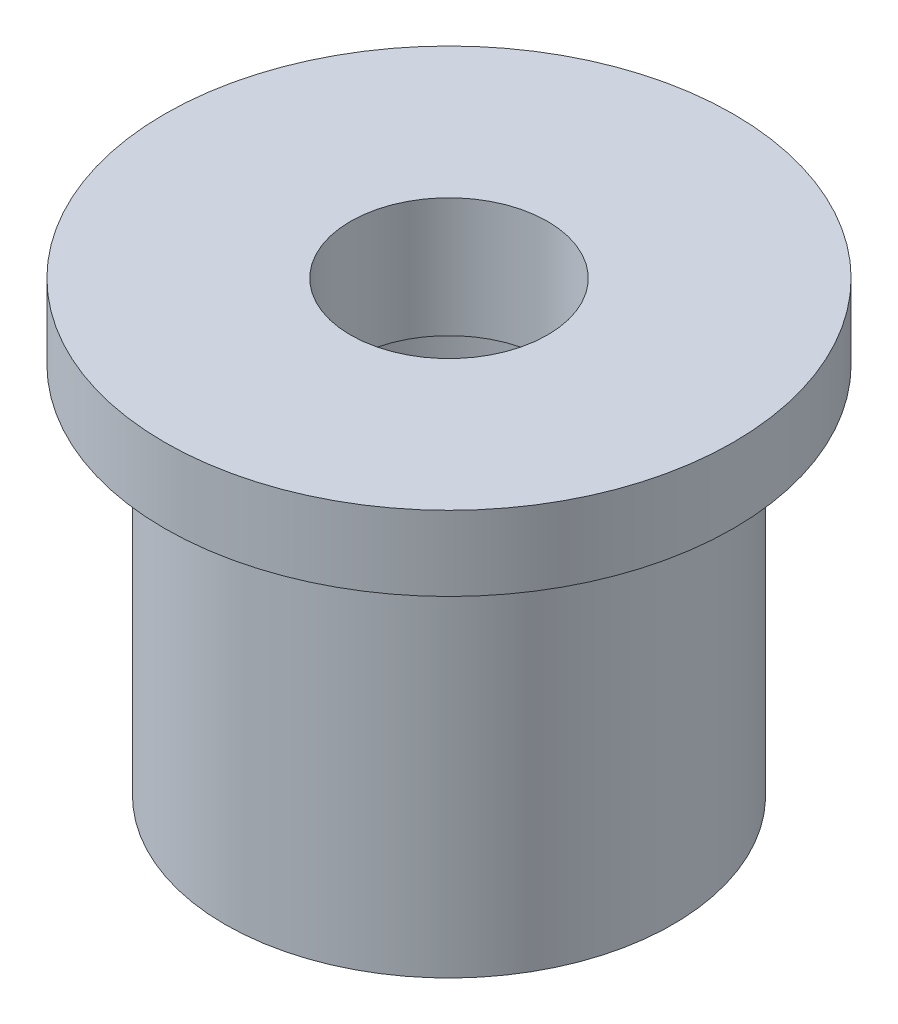
ISO-10303-21;
HEADER;
FILE_DESCRIPTION(('STEP AP214'),'2;1');
FILE_NAME('part.step','',(''),(''),'','','');
FILE_SCHEMA(('AUTOMOTIVE_DESIGN { 1 0 10303 214 1 1 1 1 }'));
ENDSEC;
DATA;
#1=APPLICATION_CONTEXT('core data for automotive mechanical design processes');
#2=APPLICATION_PROTOCOL_DEFINITION('international standard','automotive_design',2000,#1);
#3=PRODUCT_CONTEXT('',#1,'mechanical');
#4=PRODUCT('Part','Part','',(#3));
#5=PRODUCT_RELATED_PRODUCT_CATEGORY('part','',(#4));
#6=PRODUCT_DEFINITION_FORMATION('','',#4);
#7=PRODUCT_DEFINITION_CONTEXT('part definition',#1,'design');
#8=PRODUCT_DEFINITION('design','',#6,#7);
#9=PRODUCT_DEFINITION_SHAPE('','',#8);
#10=(LENGTH_UNIT() NAMED_UNIT(*) SI_UNIT(.MILLI.,.METRE.));
#11=(NAMED_UNIT(*) PLANE_ANGLE_UNIT() SI_UNIT($,.RADIAN.));
#12=(NAMED_UNIT(*) SI_UNIT($,.STERADIAN.) SOLID_ANGLE_UNIT());
#13=UNCERTAINTY_MEASURE_WITH_UNIT(LENGTH_MEASURE(1.E-05),#10,'distance_accuracy_value','');
#14=(GEOMETRIC_REPRESENTATION_CONTEXT(3) GLOBAL_UNCERTAINTY_ASSIGNED_CONTEXT((#13)) GLOBAL_UNIT_ASSIGNED_CONTEXT((#10,
#11,#12)) REPRESENTATION_CONTEXT('',''));
#15=CARTESIAN_POINT('',(0.,0.,0.));
#16=DIRECTION('',(0.,0.,1.));
#17=DIRECTION('',(1.,0.,0.));
#18=AXIS2_PLACEMENT_3D('',#15,#16,#17);
#19=CARTESIAN_POINT('',(4.3235,0.,0.));
#20=DIRECTION('',(0.,-1.,0.));
#21=DIRECTION('',(0.,0.,-1.));
#22=AXIS2_PLACEMENT_3D('',#19,#20,#21);
#23=PLANE('',#22);
#24=CARTESIAN_POINT('',(0.,0.,0.));
#25=DIRECTION('',(0.,-1.,0.));
#26=DIRECTION('',(0.,0.,-1.));
#27=AXIS2_PLACEMENT_3D('',#24,#25,#26);
#28=CIRCLE('',#27,7.5);
#29=CARTESIAN_POINT('',(0.,0.,-7.5));
#30=VERTEX_POINT('',#29);
#31=EDGE_CURVE('E12',#30,#30,#28,.T.);
#32=ORIENTED_EDGE('',*,*,#31,.T.);
#33=EDGE_LOOP('',(#32));
#34=FACE_BOUND('',#33,.T.);
#35=CARTESIAN_POINT('',(0.,0.,0.));
#36=DIRECTION('',(0.,-1.,0.));
#37=DIRECTION('',(0.,0.,-1.));
#38=AXIS2_PLACEMENT_3D('',#35,#36,#37);
#39=CIRCLE('',#38,4.3235);
#40=CARTESIAN_POINT('',(0.,0.,-4.3235));
#41=VERTEX_POINT('',#40);
#42=EDGE_CURVE('E126',#41,#41,#39,.T.);
#43=ORIENTED_EDGE('',*,*,#42,.F.);
#44=EDGE_LOOP('',(#43));
#45=FACE_BOUND('',#44,.T.);
#46=ADVANCED_FACE('F41',(#34,#45),#23,.T.);
#47=CARTESIAN_POINT('',(0.,0.,0.));
#48=DIRECTION('',(0.,-1.,0.));
#49=DIRECTION('',(0.,0.,-1.));
#50=AXIS2_PLACEMENT_3D('',#47,#48,#49);
#51=CYLINDRICAL_SURFACE('',#50,7.5);
#52=CARTESIAN_POINT('',(0.,12.5,0.));
#53=DIRECTION('',(0.,-1.,0.));
#54=DIRECTION('',(0.,0.,-1.));
#55=AXIS2_PLACEMENT_3D('',#52,#53,#54);
#56=CIRCLE('',#55,7.5);
#57=CARTESIAN_POINT('',(0.,12.5,-7.5));
#58=VERTEX_POINT('',#57);
#59=EDGE_CURVE('E47',#58,#58,#56,.T.);
#60=ORIENTED_EDGE('',*,*,#59,.T.);
#61=EDGE_LOOP('',(#60));
#62=FACE_BOUND('',#61,.T.);
#63=ORIENTED_EDGE('',*,*,#31,.F.);
#64=EDGE_LOOP('',(#63));
#65=FACE_BOUND('',#64,.T.);
#66=ADVANCED_FACE('F134',(#62,#65),#51,.T.);
#67=CARTESIAN_POINT('',(9.525,12.5,0.));
#68=DIRECTION('',(0.,-1.,0.));
#69=DIRECTION('',(0.,0.,-1.));
#70=AXIS2_PLACEMENT_3D('',#67,#68,#69);
#71=PLANE('',#70);
#72=CARTESIAN_POINT('',(0.,12.5,0.));
#73=DIRECTION('',(0.,-1.,0.));
#74=DIRECTION('',(0.,0.,-1.));
#75=AXIS2_PLACEMENT_3D('',#72,#73,#74);
#76=CIRCLE('',#75,9.525);
#77=CARTESIAN_POINT('',(0.,12.5,-9.525));
#78=VERTEX_POINT('',#77);
#79=EDGE_CURVE('E51',#78,#78,#76,.T.);
#80=ORIENTED_EDGE('',*,*,#79,.T.);
#81=EDGE_LOOP('',(#80));
#82=FACE_BOUND('',#81,.T.);
#83=ORIENTED_EDGE('',*,*,#59,.F.);
#84=EDGE_LOOP('',(#83));
#85=FACE_BOUND('',#84,.T.);
#86=ADVANCED_FACE('F138',(#82,#85),#71,.T.);
#87=CARTESIAN_POINT('',(0.,0.,0.));
#88=DIRECTION('',(0.,-1.,0.));
#89=DIRECTION('',(0.,0.,-1.));
#90=AXIS2_PLACEMENT_3D('',#87,#88,#89);
#91=CYLINDRICAL_SURFACE('',#90,9.525);
#92=CARTESIAN_POINT('',(0.,15.,0.));
#93=DIRECTION('',(0.,-1.,0.));
#94=DIRECTION('',(0.,0.,-1.));
#95=AXIS2_PLACEMENT_3D('',#92,#93,#94);
#96=CIRCLE('',#95,9.525);
#97=CARTESIAN_POINT('',(0.,15.,-9.525));
#98=VERTEX_POINT('',#97);
#99=EDGE_CURVE('E55',#98,#98,#96,.T.);
#100=ORIENTED_EDGE('',*,*,#99,.T.);
#101=EDGE_LOOP('',(#100));
#102=FACE_BOUND('',#101,.T.);
#103=ORIENTED_EDGE('',*,*,#79,.F.);
#104=EDGE_LOOP('',(#103));
#105=FACE_BOUND('',#104,.T.);
#106=ADVANCED_FACE('F142',(#102,#105),#91,.T.);
#107=CARTESIAN_POINT('',(3.3,15.,0.));
#108=DIRECTION('',(0.,1.,0.));
#109=DIRECTION('',(0.,0.,1.));
#110=AXIS2_PLACEMENT_3D('',#107,#108,#109);
#111=PLANE('',#110);
#112=CARTESIAN_POINT('',(0.,15.,0.));
#113=DIRECTION('',(0.,-1.,0.));
#114=DIRECTION('',(0.,0.,-1.));
#115=AXIS2_PLACEMENT_3D('',#112,#113,#114);
#116=CIRCLE('',#115,3.3);
#117=CARTESIAN_POINT('',(0.,15.,-3.3));
#118=VERTEX_POINT('',#117);
#119=EDGE_CURVE('E60',#118,#118,#116,.T.);
#120=ORIENTED_EDGE('',*,*,#119,.T.);
#121=EDGE_LOOP('',(#120));
#122=FACE_BOUND('',#121,.T.);
#123=ORIENTED_EDGE('',*,*,#99,.F.);
#124=EDGE_LOOP('',(#123));
#125=FACE_BOUND('',#124,.T.);
#126=ADVANCED_FACE('F149',(#122,#125),#111,.T.);
#127=CARTESIAN_POINT('',(0.,0.,0.));
#128=DIRECTION('',(0.,-1.,0.));
#129=DIRECTION('',(0.,0.,-1.));
#130=AXIS2_PLACEMENT_3D('',#127,#128,#129);
#131=CYLINDRICAL_SURFACE('',#130,3.3);
#132=CARTESIAN_POINT('',(0.,11.,0.));
#133=DIRECTION('',(0.,-1.,0.));
#134=DIRECTION('',(0.,0.,-1.));
#135=AXIS2_PLACEMENT_3D('',#132,#133,#134);
#136=CIRCLE('',#135,3.3);
#137=CARTESIAN_POINT('',(0.,11.,-3.3));
#138=VERTEX_POINT('',#137);
#139=EDGE_CURVE('E63',#138,#138,#136,.T.);
#140=ORIENTED_EDGE('',*,*,#139,.T.);
#141=EDGE_LOOP('',(#140));
#142=FACE_BOUND('',#141,.T.);
#143=ORIENTED_EDGE('',*,*,#119,.F.);
#144=EDGE_LOOP('',(#143));
#145=FACE_BOUND('',#144,.T.);
#146=ADVANCED_FACE('F153',(#142,#145),#131,.F.);
#147=CARTESIAN_POINT('',(5.,11.,0.));
#148=DIRECTION('',(0.,-1.,0.));
#149=DIRECTION('',(0.,0.,-1.));
#150=AXIS2_PLACEMENT_3D('',#147,#148,#149);
#151=PLANE('',#150);
#152=CARTESIAN_POINT('',(0.,11.,0.));
#153=DIRECTION('',(0.,-1.,0.));
#154=DIRECTION('',(0.,0.,-1.));
#155=AXIS2_PLACEMENT_3D('',#152,#153,#154);
#156=CIRCLE('',#155,5.);
#157=CARTESIAN_POINT('',(0.,11.,-5.));
#158=VERTEX_POINT('',#157);
#159=EDGE_CURVE('E66',#158,#158,#156,.T.);
#160=ORIENTED_EDGE('',*,*,#159,.T.);
#161=EDGE_LOOP('',(#160));
#162=FACE_BOUND('',#161,.T.);
#163=ORIENTED_EDGE('',*,*,#139,.F.);
#164=EDGE_LOOP('',(#163));
#165=FACE_BOUND('',#164,.T.);
#166=ADVANCED_FACE('F157',(#162,#165),#151,.T.);
#167=CARTESIAN_POINT('',(0.,0.,0.));
#168=DIRECTION('',(0.,-1.,0.));
#169=DIRECTION('',(0.,0.,-1.));
#170=AXIS2_PLACEMENT_3D('',#167,#168,#169);
#171=CYLINDRICAL_SURFACE('',#170,5.);
#172=CARTESIAN_POINT('',(0.,9.,0.));
#173=DIRECTION('',(0.,-1.,0.));
#174=DIRECTION('',(0.,0.,-1.));
#175=AXIS2_PLACEMENT_3D('',#172,#173,#174);
#176=CIRCLE('',#175,5.);
#177=CARTESIAN_POINT('',(0.,9.,-5.));
#178=VERTEX_POINT('',#177);
#179=EDGE_CURVE('E69',#178,#178,#176,.T.);
#180=ORIENTED_EDGE('',*,*,#179,.T.);
#181=EDGE_LOOP('',(#180));
#182=FACE_BOUND('',#181,.T.);
#183=ORIENTED_EDGE('',*,*,#159,.F.);
#184=EDGE_LOOP('',(#183));
#185=FACE_BOUND('',#184,.T.);
#186=ADVANCED_FACE('F161',(#182,#185),#171,.F.);
#187=CARTESIAN_POINT('',(5.,9.,0.));
#188=DIRECTION('',(0.,1.,0.));
#189=DIRECTION('',(0.,0.,1.));
#190=AXIS2_PLACEMENT_3D('',#187,#188,#189);
#191=PLANE('',#190);
#192=CARTESIAN_POINT('',(0.,9.,0.));
#193=DIRECTION('',(0.,-1.,0.));
#194=DIRECTION('',(0.,0.,-1.));
#195=AXIS2_PLACEMENT_3D('',#192,#193,#194);
#196=CIRCLE('',#195,4.3235);
#197=CARTESIAN_POINT('',(0.,9.,-4.3235));
#198=VERTEX_POINT('',#197);
#199=EDGE_CURVE('E72',#198,#198,#196,.T.);
#200=ORIENTED_EDGE('',*,*,#199,.T.);
#201=EDGE_LOOP('',(#200));
#202=FACE_BOUND('',#201,.T.);
#203=ORIENTED_EDGE('',*,*,#179,.F.);
#204=EDGE_LOOP('',(#203));
#205=FACE_BOUND('',#204,.T.);
#206=ADVANCED_FACE('F165',(#202,#205),#191,.T.);
#207=CARTESIAN_POINT('',(0.,9.,0.));
#208=DIRECTION('',(0.,-1.,0.));
#209=DIRECTION('',(0.,0.,-1.));
#210=AXIS2_PLACEMENT_3D('',#207,#208,#209);
#211=CONICAL_SURFACE('',#210,4.3235,0.934308892818701);
#212=CARTESIAN_POINT('',(0.,8.5,0.));
#213=DIRECTION('',(0.,-1.,0.));
#214=DIRECTION('',(0.,0.,-1.));
#215=AXIS2_PLACEMENT_3D('',#212,#213,#214);
#216=CIRCLE('',#215,5.);
#217=CARTESIAN_POINT('',(0.,8.5,-5.));
#218=VERTEX_POINT('',#217);
#219=EDGE_CURVE('E75',#218,#218,#216,.T.);
#220=ORIENTED_EDGE('',*,*,#219,.T.);
#221=EDGE_LOOP('',(#220));
#222=FACE_BOUND('',#221,.T.);
#223=ORIENTED_EDGE('',*,*,#199,.F.);
#224=EDGE_LOOP('',(#223));
#225=FACE_BOUND('',#224,.T.);
#226=ADVANCED_FACE('F169',(#222,#225),#211,.F.);
#227=CARTESIAN_POINT('',(0.,8.5,0.));
#228=DIRECTION('',(0.,1.,0.));
#229=DIRECTION('',(0.,0.,1.));
#230=AXIS2_PLACEMENT_3D('',#227,#228,#229);
#231=CONICAL_SURFACE('',#230,5.,0.934308892818702);
#232=CARTESIAN_POINT('',(0.,8.,0.));
#233=DIRECTION('',(0.,-1.,0.));
#234=DIRECTION('',(0.,0.,-1.));
#235=AXIS2_PLACEMENT_3D('',#232,#233,#234);
#236=CIRCLE('',#235,4.3235);
#237=CARTESIAN_POINT('',(0.,8.,-4.3235));
#238=VERTEX_POINT('',#237);
#239=EDGE_CURVE('E78',#238,#238,#236,.T.);
#240=ORIENTED_EDGE('',*,*,#239,.T.);
#241=EDGE_LOOP('',(#240));
#242=FACE_BOUND('',#241,.T.);
#243=ORIENTED_EDGE('',*,*,#219,.F.);
#244=EDGE_LOOP('',(#243));
#245=FACE_BOUND('',#244,.T.);
#246=ADVANCED_FACE('F173',(#242,#245),#231,.F.);
#247=CARTESIAN_POINT('',(0.,8.,0.));
#248=DIRECTION('',(0.,-1.,0.));
#249=DIRECTION('',(0.,0.,-1.));
#250=AXIS2_PLACEMENT_3D('',#247,#248,#249);
#251=CONICAL_SURFACE('',#250,4.3235,0.934308892818701);
#252=CARTESIAN_POINT('',(0.,7.5,0.));
#253=DIRECTION('',(0.,-1.,0.));
#254=DIRECTION('',(0.,0.,-1.));
#255=AXIS2_PLACEMENT_3D('',#252,#253,#254);
#256=CIRCLE('',#255,5.);
#257=CARTESIAN_POINT('',(0.,7.5,-5.));
#258=VERTEX_POINT('',#257);
#259=EDGE_CURVE('E81',#258,#258,#256,.T.);
#260=ORIENTED_EDGE('',*,*,#259,.T.);
#261=EDGE_LOOP('',(#260));
#262=FACE_BOUND('',#261,.T.);
#263=ORIENTED_EDGE('',*,*,#239,.F.);
#264=EDGE_LOOP('',(#263));
#265=FACE_BOUND('',#264,.T.);
#266=ADVANCED_FACE('F177',(#262,#265),#251,.F.);
#267=CARTESIAN_POINT('',(0.,7.5,0.));
#268=DIRECTION('',(0.,1.,0.));
#269=DIRECTION('',(0.,0.,1.));
#270=AXIS2_PLACEMENT_3D('',#267,#268,#269);
#271=CONICAL_SURFACE('',#270,5.,0.934308892818703);
#272=CARTESIAN_POINT('',(0.,7.,0.));
#273=DIRECTION('',(0.,-1.,0.));
#274=DIRECTION('',(0.,0.,-1.));
#275=AXIS2_PLACEMENT_3D('',#272,#273,#274);
#276=CIRCLE('',#275,4.3235);
#277=CARTESIAN_POINT('',(0.,7.,-4.3235));
#278=VERTEX_POINT('',#277);
#279=EDGE_CURVE('E84',#278,#278,#276,.T.);
#280=ORIENTED_EDGE('',*,*,#279,.T.);
#281=EDGE_LOOP('',(#280));
#282=FACE_BOUND('',#281,.T.);
#283=ORIENTED_EDGE('',*,*,#259,.F.);
#284=EDGE_LOOP('',(#283));
#285=FACE_BOUND('',#284,.T.);
#286=ADVANCED_FACE('F181',(#282,#285),#271,.F.);
#287=CARTESIAN_POINT('',(0.,7.,0.));
#288=DIRECTION('',(0.,-1.,0.));
#289=DIRECTION('',(0.,0.,-1.));
#290=AXIS2_PLACEMENT_3D('',#287,#288,#289);
#291=CONICAL_SURFACE('',#290,4.3235,0.934308892818701);
#292=CARTESIAN_POINT('',(0.,6.5,0.));
#293=DIRECTION('',(0.,-1.,0.));
#294=DIRECTION('',(0.,0.,-1.));
#295=AXIS2_PLACEMENT_3D('',#292,#293,#294);
#296=CIRCLE('',#295,5.);
#297=CARTESIAN_POINT('',(0.,6.5,-5.));
#298=VERTEX_POINT('',#297);
#299=EDGE_CURVE('E87',#298,#298,#296,.T.);
#300=ORIENTED_EDGE('',*,*,#299,.T.);
#301=EDGE_LOOP('',(#300));
#302=FACE_BOUND('',#301,.T.);
#303=ORIENTED_EDGE('',*,*,#279,.F.);
#304=EDGE_LOOP('',(#303));
#305=FACE_BOUND('',#304,.T.);
#306=ADVANCED_FACE('F185',(#302,#305),#291,.F.);
#307=CARTESIAN_POINT('',(0.,6.5,0.));
#308=DIRECTION('',(0.,1.,0.));
#309=DIRECTION('',(0.,0.,1.));
#310=AXIS2_PLACEMENT_3D('',#307,#308,#309);
#311=CONICAL_SURFACE('',#310,5.,0.934308892818702);
#312=CARTESIAN_POINT('',(0.,6.,0.));
#313=DIRECTION('',(0.,-1.,0.));
#314=DIRECTION('',(0.,0.,-1.));
#315=AXIS2_PLACEMENT_3D('',#312,#313,#314);
#316=CIRCLE('',#315,4.3235);
#317=CARTESIAN_POINT('',(0.,6.,-4.3235));
#318=VERTEX_POINT('',#317);
#319=EDGE_CURVE('E90',#318,#318,#316,.T.);
#320=ORIENTED_EDGE('',*,*,#319,.T.);
#321=EDGE_LOOP('',(#320));
#322=FACE_BOUND('',#321,.T.);
#323=ORIENTED_EDGE('',*,*,#299,.F.);
#324=EDGE_LOOP('',(#323));
#325=FACE_BOUND('',#324,.T.);
#326=ADVANCED_FACE('F189',(#322,#325),#311,.F.);
#327=CARTESIAN_POINT('',(0.,6.,0.));
#328=DIRECTION('',(0.,-1.,0.));
#329=DIRECTION('',(0.,0.,-1.));
#330=AXIS2_PLACEMENT_3D('',#327,#328,#329);
#331=CONICAL_SURFACE('',#330,4.3235,0.934308892818701);
#332=CARTESIAN_POINT('',(0.,5.5,0.));
#333=DIRECTION('',(0.,-1.,0.));
#334=DIRECTION('',(0.,0.,-1.));
#335=AXIS2_PLACEMENT_3D('',#332,#333,#334);
#336=CIRCLE('',#335,5.);
#337=CARTESIAN_POINT('',(0.,5.5,-5.));
#338=VERTEX_POINT('',#337);
#339=EDGE_CURVE('E93',#338,#338,#336,.T.);
#340=ORIENTED_EDGE('',*,*,#339,.T.);
#341=EDGE_LOOP('',(#340));
#342=FACE_BOUND('',#341,.T.);
#343=ORIENTED_EDGE('',*,*,#319,.F.);
#344=EDGE_LOOP('',(#343));
#345=FACE_BOUND('',#344,.T.);
#346=ADVANCED_FACE('F193',(#342,#345),#331,.F.);
#347=CARTESIAN_POINT('',(0.,5.5,0.));
#348=DIRECTION('',(0.,1.,0.));
#349=DIRECTION('',(0.,0.,1.));
#350=AXIS2_PLACEMENT_3D('',#347,#348,#349);
#351=CONICAL_SURFACE('',#350,5.,0.934308892818702);
#352=CARTESIAN_POINT('',(0.,5.00000000000001,0.));
#353=DIRECTION('',(0.,-1.,0.));
#354=DIRECTION('',(0.,0.,-1.));
#355=AXIS2_PLACEMENT_3D('',#352,#353,#354);
#356=CIRCLE('',#355,4.3235);
#357=CARTESIAN_POINT('',(0.,5.00000000000001,-4.3235));
#358=VERTEX_POINT('',#357);
#359=EDGE_CURVE('E96',#358,#358,#356,.T.);
#360=ORIENTED_EDGE('',*,*,#359,.T.);
#361=EDGE_LOOP('',(#360));
#362=FACE_BOUND('',#361,.T.);
#363=ORIENTED_EDGE('',*,*,#339,.F.);
#364=EDGE_LOOP('',(#363));
#365=FACE_BOUND('',#364,.T.);
#366=ADVANCED_FACE('F197',(#362,#365),#351,.F.);
#367=CARTESIAN_POINT('',(0.,5.00000000000001,0.));
#368=DIRECTION('',(0.,-1.,0.));
#369=DIRECTION('',(0.,0.,-1.));
#370=AXIS2_PLACEMENT_3D('',#367,#368,#369);
#371=CONICAL_SURFACE('',#370,4.3235,0.934308892818701);
#372=CARTESIAN_POINT('',(0.,4.50000000000001,0.));
#373=DIRECTION('',(0.,-1.,0.));
#374=DIRECTION('',(0.,0.,-1.));
#375=AXIS2_PLACEMENT_3D('',#372,#373,#374);
#376=CIRCLE('',#375,5.);
#377=CARTESIAN_POINT('',(0.,4.50000000000001,-5.));
#378=VERTEX_POINT('',#377);
#379=EDGE_CURVE('E99',#378,#378,#376,.T.);
#380=ORIENTED_EDGE('',*,*,#379,.T.);
#381=EDGE_LOOP('',(#380));
#382=FACE_BOUND('',#381,.T.);
#383=ORIENTED_EDGE('',*,*,#359,.F.);
#384=EDGE_LOOP('',(#383));
#385=FACE_BOUND('',#384,.T.);
#386=ADVANCED_FACE('F201',(#382,#385),#371,.F.);
#387=CARTESIAN_POINT('',(0.,4.50000000000001,0.));
#388=DIRECTION('',(0.,1.,0.));
#389=DIRECTION('',(0.,0.,1.));
#390=AXIS2_PLACEMENT_3D('',#387,#388,#389);
#391=CONICAL_SURFACE('',#390,5.,0.934308892818702);
#392=CARTESIAN_POINT('',(0.,4.00000000000001,0.));
#393=DIRECTION('',(0.,-1.,0.));
#394=DIRECTION('',(0.,0.,-1.));
#395=AXIS2_PLACEMENT_3D('',#392,#393,#394);
#396=CIRCLE('',#395,4.3235);
#397=CARTESIAN_POINT('',(0.,4.00000000000001,-4.3235));
#398=VERTEX_POINT('',#397);
#399=EDGE_CURVE('E102',#398,#398,#396,.T.);
#400=ORIENTED_EDGE('',*,*,#399,.T.);
#401=EDGE_LOOP('',(#400));
#402=FACE_BOUND('',#401,.T.);
#403=ORIENTED_EDGE('',*,*,#379,.F.);
#404=EDGE_LOOP('',(#403));
#405=FACE_BOUND('',#404,.T.);
#406=ADVANCED_FACE('F205',(#402,#405),#391,.F.);
#407=CARTESIAN_POINT('',(0.,4.00000000000001,0.));
#408=DIRECTION('',(0.,-1.,0.));
#409=DIRECTION('',(0.,0.,-1.));
#410=AXIS2_PLACEMENT_3D('',#407,#408,#409);
#411=CONICAL_SURFACE('',#410,4.3235,0.934308892818702);
#412=CARTESIAN_POINT('',(0.,3.50000000000001,0.));
#413=DIRECTION('',(0.,-1.,0.));
#414=DIRECTION('',(0.,0.,-1.));
#415=AXIS2_PLACEMENT_3D('',#412,#413,#414);
#416=CIRCLE('',#415,5.);
#417=CARTESIAN_POINT('',(0.,3.50000000000001,-5.));
#418=VERTEX_POINT('',#417);
#419=EDGE_CURVE('E105',#418,#418,#416,.T.);
#420=ORIENTED_EDGE('',*,*,#419,.T.);
#421=EDGE_LOOP('',(#420));
#422=FACE_BOUND('',#421,.T.);
#423=ORIENTED_EDGE('',*,*,#399,.F.);
#424=EDGE_LOOP('',(#423));
#425=FACE_BOUND('',#424,.T.);
#426=ADVANCED_FACE('F209',(#422,#425),#411,.F.);
#427=CARTESIAN_POINT('',(0.,3.50000000000001,0.));
#428=DIRECTION('',(0.,1.,0.));
#429=DIRECTION('',(0.,0.,1.));
#430=AXIS2_PLACEMENT_3D('',#427,#428,#429);
#431=CONICAL_SURFACE('',#430,5.,0.934308892818701);
#432=CARTESIAN_POINT('',(0.,3.00000000000001,0.));
#433=DIRECTION('',(0.,-1.,0.));
#434=DIRECTION('',(0.,0.,-1.));
#435=AXIS2_PLACEMENT_3D('',#432,#433,#434);
#436=CIRCLE('',#435,4.3235);
#437=CARTESIAN_POINT('',(0.,3.00000000000001,-4.3235));
#438=VERTEX_POINT('',#437);
#439=EDGE_CURVE('E108',#438,#438,#436,.T.);
#440=ORIENTED_EDGE('',*,*,#439,.T.);
#441=EDGE_LOOP('',(#440));
#442=FACE_BOUND('',#441,.T.);
#443=ORIENTED_EDGE('',*,*,#419,.F.);
#444=EDGE_LOOP('',(#443));
#445=FACE_BOUND('',#444,.T.);
#446=ADVANCED_FACE('F213',(#442,#445),#431,.F.);
#447=CARTESIAN_POINT('',(0.,3.00000000000001,0.));
#448=DIRECTION('',(0.,-1.,0.));
#449=DIRECTION('',(0.,0.,-1.));
#450=AXIS2_PLACEMENT_3D('',#447,#448,#449);
#451=CONICAL_SURFACE('',#450,4.3235,0.934308892818701);
#452=CARTESIAN_POINT('',(0.,2.50000000000001,0.));
#453=DIRECTION('',(0.,-1.,0.));
#454=DIRECTION('',(0.,0.,-1.));
#455=AXIS2_PLACEMENT_3D('',#452,#453,#454);
#456=CIRCLE('',#455,5.);
#457=CARTESIAN_POINT('',(0.,2.50000000000001,-5.));
#458=VERTEX_POINT('',#457);
#459=EDGE_CURVE('E111',#458,#458,#456,.T.);
#460=ORIENTED_EDGE('',*,*,#459,.T.);
#461=EDGE_LOOP('',(#460));
#462=FACE_BOUND('',#461,.T.);
#463=ORIENTED_EDGE('',*,*,#439,.F.);
#464=EDGE_LOOP('',(#463));
#465=FACE_BOUND('',#464,.T.);
#466=ADVANCED_FACE('F217',(#462,#465),#451,.F.);
#467=CARTESIAN_POINT('',(0.,2.50000000000001,0.));
#468=DIRECTION('',(0.,1.,0.));
#469=DIRECTION('',(0.,0.,1.));
#470=AXIS2_PLACEMENT_3D('',#467,#468,#469);
#471=CONICAL_SURFACE('',#470,5.,0.934308892818702);
#472=CARTESIAN_POINT('',(0.,2.00000000000001,0.));
#473=DIRECTION('',(0.,-1.,0.));
#474=DIRECTION('',(0.,0.,-1.));
#475=AXIS2_PLACEMENT_3D('',#472,#473,#474);
#476=CIRCLE('',#475,4.3235);
#477=CARTESIAN_POINT('',(0.,2.00000000000001,-4.3235));
#478=VERTEX_POINT('',#477);
#479=EDGE_CURVE('E114',#478,#478,#476,.T.);
#480=ORIENTED_EDGE('',*,*,#479,.T.);
#481=EDGE_LOOP('',(#480));
#482=FACE_BOUND('',#481,.T.);
#483=ORIENTED_EDGE('',*,*,#459,.F.);
#484=EDGE_LOOP('',(#483));
#485=FACE_BOUND('',#484,.T.);
#486=ADVANCED_FACE('F221',(#482,#485),#471,.F.);
#487=CARTESIAN_POINT('',(0.,2.00000000000001,0.));
#488=DIRECTION('',(0.,-1.,0.));
#489=DIRECTION('',(0.,0.,-1.));
#490=AXIS2_PLACEMENT_3D('',#487,#488,#489);
#491=CONICAL_SURFACE('',#490,4.3235,0.934308892818701);
#492=CARTESIAN_POINT('',(0.,1.50000000000001,0.));
#493=DIRECTION('',(0.,-1.,0.));
#494=DIRECTION('',(0.,0.,-1.));
#495=AXIS2_PLACEMENT_3D('',#492,#493,#494);
#496=CIRCLE('',#495,5.);
#497=CARTESIAN_POINT('',(0.,1.50000000000001,-5.));
#498=VERTEX_POINT('',#497);
#499=EDGE_CURVE('E117',#498,#498,#496,.T.);
#500=ORIENTED_EDGE('',*,*,#499,.T.);
#501=EDGE_LOOP('',(#500));
#502=FACE_BOUND('',#501,.T.);
#503=ORIENTED_EDGE('',*,*,#479,.F.);
#504=EDGE_LOOP('',(#503));
#505=FACE_BOUND('',#504,.T.);
#506=ADVANCED_FACE('F225',(#502,#505),#491,.F.);
#507=CARTESIAN_POINT('',(0.,1.50000000000001,0.));
#508=DIRECTION('',(0.,1.,0.));
#509=DIRECTION('',(0.,0.,1.));
#510=AXIS2_PLACEMENT_3D('',#507,#508,#509);
#511=CONICAL_SURFACE('',#510,5.,0.934308892818702);
#512=CARTESIAN_POINT('',(0.,1.00000000000001,0.));
#513=DIRECTION('',(0.,-1.,0.));
#514=DIRECTION('',(0.,0.,-1.));
#515=AXIS2_PLACEMENT_3D('',#512,#513,#514);
#516=CIRCLE('',#515,4.3235);
#517=CARTESIAN_POINT('',(0.,1.00000000000001,-4.3235));
#518=VERTEX_POINT('',#517);
#519=EDGE_CURVE('E120',#518,#518,#516,.T.);
#520=ORIENTED_EDGE('',*,*,#519,.T.);
#521=EDGE_LOOP('',(#520));
#522=FACE_BOUND('',#521,.T.);
#523=ORIENTED_EDGE('',*,*,#499,.F.);
#524=EDGE_LOOP('',(#523));
#525=FACE_BOUND('',#524,.T.);
#526=ADVANCED_FACE('F229',(#522,#525),#511,.F.);
#527=CARTESIAN_POINT('',(0.,1.00000000000001,0.));
#528=DIRECTION('',(0.,-1.,0.));
#529=DIRECTION('',(0.,0.,-1.));
#530=AXIS2_PLACEMENT_3D('',#527,#528,#529);
#531=CONICAL_SURFACE('',#530,4.3235,0.934308892818701);
#532=CARTESIAN_POINT('',(0.,0.500000000000011,0.));
#533=DIRECTION('',(0.,-1.,0.));
#534=DIRECTION('',(0.,0.,-1.));
#535=AXIS2_PLACEMENT_3D('',#532,#533,#534);
#536=CIRCLE('',#535,5.);
#537=CARTESIAN_POINT('',(0.,0.500000000000011,-5.));
#538=VERTEX_POINT('',#537);
#539=EDGE_CURVE('E123',#538,#538,#536,.T.);
#540=ORIENTED_EDGE('',*,*,#539,.T.);
#541=EDGE_LOOP('',(#540));
#542=FACE_BOUND('',#541,.T.);
#543=ORIENTED_EDGE('',*,*,#519,.F.);
#544=EDGE_LOOP('',(#543));
#545=FACE_BOUND('',#544,.T.);
#546=ADVANCED_FACE('F233',(#542,#545),#531,.F.);
#547=CARTESIAN_POINT('',(0.,0.500000000000011,0.));
#548=DIRECTION('',(0.,1.,0.));
#549=DIRECTION('',(0.,0.,1.));
#550=AXIS2_PLACEMENT_3D('',#547,#548,#549);
#551=CONICAL_SURFACE('',#550,5.,0.93430889281869);
#552=ORIENTED_EDGE('',*,*,#42,.T.);
#553=EDGE_LOOP('',(#552));
#554=FACE_BOUND('',#553,.T.);
#555=ORIENTED_EDGE('',*,*,#539,.F.);
#556=EDGE_LOOP('',(#555));
#557=FACE_BOUND('',#556,.T.);
#558=ADVANCED_FACE('F130',(#554,#557),#551,.F.);
#559=CLOSED_SHELL('',(#46,#66,#86,#106,#126,#146,#166,#186,#206,#226,#246,#266,#286,#306,#326,
#346,#366,#386,#406,#426,#446,#466,#486,#506,#526,#546,#558));
#560=MANIFOLD_SOLID_BREP('B2',#559);
#561=ADVANCED_BREP_SHAPE_REPRESENTATION('',(#18,#560),#14);
#562=SHAPE_DEFINITION_REPRESENTATION(#9,#561);
ENDSEC;
END-ISO-10303-21;
